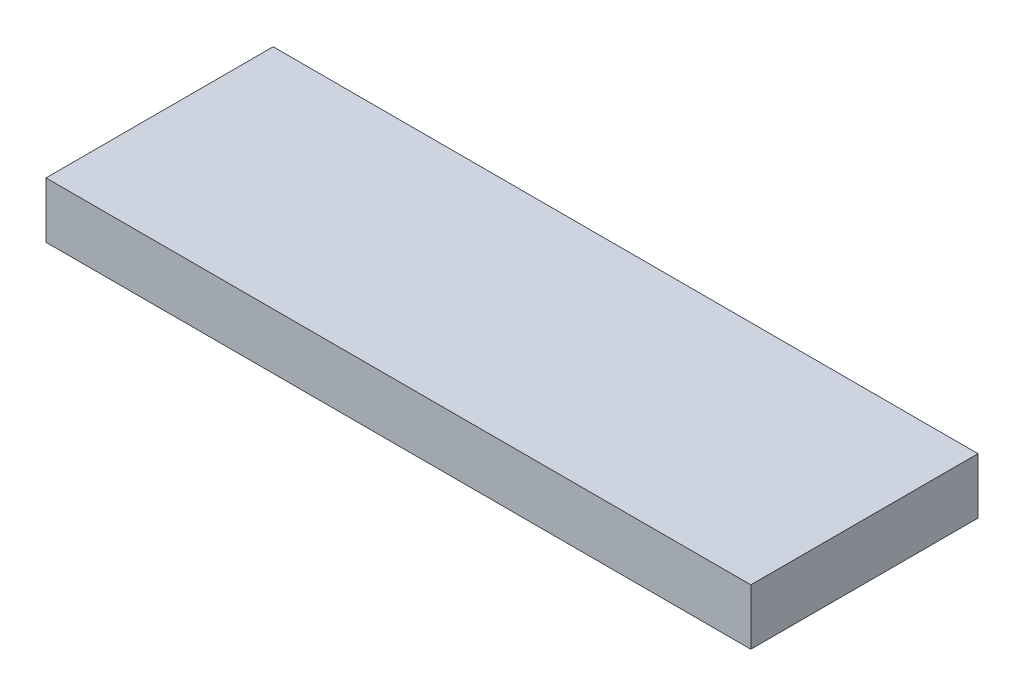
ISO-10303-21;
HEADER;
FILE_DESCRIPTION(('STEP AP214'),'2;1');
FILE_NAME('part.step','',(''),(''),'','','');
FILE_SCHEMA(('AUTOMOTIVE_DESIGN { 1 0 10303 214 1 1 1 1 }'));
ENDSEC;
DATA;
#1=APPLICATION_CONTEXT('core data for automotive mechanical design processes');
#2=APPLICATION_PROTOCOL_DEFINITION('international standard','automotive_design',2000,#1);
#3=PRODUCT_CONTEXT('',#1,'mechanical');
#4=PRODUCT('Part','Part','',(#3));
#5=PRODUCT_RELATED_PRODUCT_CATEGORY('part','',(#4));
#6=PRODUCT_DEFINITION_FORMATION('','',#4);
#7=PRODUCT_DEFINITION_CONTEXT('part definition',#1,'design');
#8=PRODUCT_DEFINITION('design','',#6,#7);
#9=PRODUCT_DEFINITION_SHAPE('','',#8);
#10=(LENGTH_UNIT() NAMED_UNIT(*) SI_UNIT(.MILLI.,.METRE.));
#11=(NAMED_UNIT(*) PLANE_ANGLE_UNIT() SI_UNIT($,.RADIAN.));
#12=(NAMED_UNIT(*) SI_UNIT($,.STERADIAN.) SOLID_ANGLE_UNIT());
#13=UNCERTAINTY_MEASURE_WITH_UNIT(LENGTH_MEASURE(1.E-05),#10,'distance_accuracy_value','');
#14=(GEOMETRIC_REPRESENTATION_CONTEXT(3) GLOBAL_UNCERTAINTY_ASSIGNED_CONTEXT((#13)) GLOBAL_UNIT_ASSIGNED_CONTEXT((#10,
#11,#12)) REPRESENTATION_CONTEXT('',''));
#15=CARTESIAN_POINT('',(0.,0.,0.));
#16=DIRECTION('',(0.,0.,1.));
#17=DIRECTION('',(1.,0.,0.));
#18=AXIS2_PLACEMENT_3D('',#15,#16,#17);
#19=CARTESIAN_POINT('',(10.09949212,-0.79949294,0.));
#20=DIRECTION('',(0.,-1.,0.));
#21=DIRECTION('',(0.,0.,-1.));
#22=AXIS2_PLACEMENT_3D('',#19,#20,#21);
#23=PLANE('',#22);
#24=DIRECTION('',(0.,0.,1.));
#25=VECTOR('',#24,1.);
#26=CARTESIAN_POINT('',(-10.09949212,-0.79949294,0.));
#27=LINE('',#26,#25);
#28=CARTESIAN_POINT('',(-10.09949212,-0.79949294,0.));
#29=VERTEX_POINT('',#28);
#30=CARTESIAN_POINT('',(-10.09949212,-0.79949294,6.51000222));
#31=VERTEX_POINT('',#30);
#32=EDGE_CURVE('E20',#29,#31,#27,.T.);
#33=ORIENTED_EDGE('',*,*,#32,.F.);
#34=DIRECTION('',(1.,0.,0.));
#35=VECTOR('',#34,1.);
#36=CARTESIAN_POINT('',(-10.09949212,-0.79949294,0.));
#37=LINE('',#36,#35);
#38=CARTESIAN_POINT('',(10.09949212,-0.79949294,0.));
#39=VERTEX_POINT('',#38);
#40=EDGE_CURVE('E79',#29,#39,#37,.T.);
#41=ORIENTED_EDGE('',*,*,#40,.T.);
#42=DIRECTION('',(0.,0.,-1.));
#43=VECTOR('',#42,1.);
#44=CARTESIAN_POINT('',(10.09949212,-0.79949294,0.));
#45=LINE('',#44,#43);
#46=CARTESIAN_POINT('',(10.09949212,-0.79949294,6.51000222));
#47=VERTEX_POINT('',#46);
#48=EDGE_CURVE('E61',#47,#39,#45,.T.);
#49=ORIENTED_EDGE('',*,*,#48,.F.);
#50=DIRECTION('',(1.,0.,0.));
#51=VECTOR('',#50,1.);
#52=CARTESIAN_POINT('',(-10.09949212,-0.79949294,6.51000222));
#53=LINE('',#52,#51);
#54=EDGE_CURVE('E56',#31,#47,#53,.T.);
#55=ORIENTED_EDGE('',*,*,#54,.F.);
#56=EDGE_LOOP('',(#33,#41,#49,#55));
#57=FACE_BOUND('',#56,.T.);
#58=ADVANCED_FACE('F17',(#57),#23,.T.);
#59=CARTESIAN_POINT('',(-10.09949212,-0.79949294,0.));
#60=DIRECTION('',(-1.,0.,0.));
#61=DIRECTION('',(0.,0.,1.));
#62=AXIS2_PLACEMENT_3D('',#59,#60,#61);
#63=PLANE('',#62);
#64=DIRECTION('',(0.,0.,1.));
#65=VECTOR('',#64,1.);
#66=CARTESIAN_POINT('',(-10.09949212,0.79949294,0.));
#67=LINE('',#66,#65);
#68=CARTESIAN_POINT('',(-10.09949212,0.79949294,0.));
#69=VERTEX_POINT('',#68);
#70=CARTESIAN_POINT('',(-10.09949212,0.79949294,6.51000222));
#71=VERTEX_POINT('',#70);
#72=EDGE_CURVE('E83',#69,#71,#67,.T.);
#73=ORIENTED_EDGE('',*,*,#72,.F.);
#74=DIRECTION('',(0.,1.,0.));
#75=VECTOR('',#74,1.);
#76=CARTESIAN_POINT('',(-10.09949212,-0.79949294,0.));
#77=LINE('',#76,#75);
#78=EDGE_CURVE('E68',#69,#29,#77,.F.);
#79=ORIENTED_EDGE('',*,*,#78,.T.);
#80=ORIENTED_EDGE('',*,*,#32,.T.);
#81=DIRECTION('',(0.,1.,0.));
#82=VECTOR('',#81,1.);
#83=CARTESIAN_POINT('',(-10.09949212,-0.79949294,6.51000222));
#84=LINE('',#83,#82);
#85=EDGE_CURVE('E63',#71,#31,#84,.F.);
#86=ORIENTED_EDGE('',*,*,#85,.F.);
#87=EDGE_LOOP('',(#73,#79,#80,#86));
#88=FACE_BOUND('',#87,.T.);
#89=ADVANCED_FACE('F65',(#88),#63,.T.);
#90=CARTESIAN_POINT('',(-10.09949212,-0.79949294,6.51000222));
#91=DIRECTION('',(0.,0.,1.));
#92=DIRECTION('',(1.,0.,0.));
#93=AXIS2_PLACEMENT_3D('',#90,#91,#92);
#94=PLANE('',#93);
#95=DIRECTION('',(1.,0.,0.));
#96=VECTOR('',#95,1.);
#97=CARTESIAN_POINT('',(-10.09949212,0.79949294,6.51000222));
#98=LINE('',#97,#96);
#99=CARTESIAN_POINT('',(10.09949212,0.79949294,6.51000222));
#100=VERTEX_POINT('',#99);
#101=EDGE_CURVE('E72',#71,#100,#98,.T.);
#102=ORIENTED_EDGE('',*,*,#101,.F.);
#103=ORIENTED_EDGE('',*,*,#85,.T.);
#104=ORIENTED_EDGE('',*,*,#54,.T.);
#105=DIRECTION('',(0.,1.,0.));
#106=VECTOR('',#105,1.);
#107=CARTESIAN_POINT('',(10.09949212,0.79949294,6.51000222));
#108=LINE('',#107,#106);
#109=EDGE_CURVE('E74',#100,#47,#108,.F.);
#110=ORIENTED_EDGE('',*,*,#109,.F.);
#111=EDGE_LOOP('',(#102,#103,#104,#110));
#112=FACE_BOUND('',#111,.T.);
#113=ADVANCED_FACE('F70',(#112),#94,.T.);
#114=CARTESIAN_POINT('',(10.09949212,0.79949294,0.));
#115=DIRECTION('',(1.,0.,0.));
#116=DIRECTION('',(0.,0.,-1.));
#117=AXIS2_PLACEMENT_3D('',#114,#115,#116);
#118=PLANE('',#117);
#119=ORIENTED_EDGE('',*,*,#48,.T.);
#120=DIRECTION('',(0.,1.,0.));
#121=VECTOR('',#120,1.);
#122=CARTESIAN_POINT('',(10.09949212,-0.79949294,0.));
#123=LINE('',#122,#121);
#124=CARTESIAN_POINT('',(10.09949212,0.79949294,0.));
#125=VERTEX_POINT('',#124);
#126=EDGE_CURVE('E35',#39,#125,#123,.T.);
#127=ORIENTED_EDGE('',*,*,#126,.T.);
#128=DIRECTION('',(0.,0.,1.));
#129=VECTOR('',#128,1.);
#130=CARTESIAN_POINT('',(10.09949212,0.79949294,0.));
#131=LINE('',#130,#129);
#132=EDGE_CURVE('E26',#100,#125,#131,.F.);
#133=ORIENTED_EDGE('',*,*,#132,.F.);
#134=ORIENTED_EDGE('',*,*,#109,.T.);
#135=EDGE_LOOP('',(#119,#127,#133,#134));
#136=FACE_BOUND('',#135,.T.);
#137=ADVANCED_FACE('F89',(#136),#118,.T.);
#138=CARTESIAN_POINT('',(-10.09949212,-0.79949294,0.));
#139=DIRECTION('',(0.,0.,1.));
#140=DIRECTION('',(1.,0.,0.));
#141=AXIS2_PLACEMENT_3D('',#138,#139,#140);
#142=PLANE('',#141);
#143=DIRECTION('',(1.,0.,0.));
#144=VECTOR('',#143,1.);
#145=CARTESIAN_POINT('',(-10.09949212,0.79949294,0.));
#146=LINE('',#145,#144);
#147=EDGE_CURVE('E11',#125,#69,#146,.F.);
#148=ORIENTED_EDGE('',*,*,#147,.F.);
#149=ORIENTED_EDGE('',*,*,#126,.F.);
#150=ORIENTED_EDGE('',*,*,#40,.F.);
#151=ORIENTED_EDGE('',*,*,#78,.F.);
#152=EDGE_LOOP('',(#148,#149,#150,#151));
#153=FACE_BOUND('',#152,.T.);
#154=ADVANCED_FACE('F91',(#153),#142,.F.);
#155=CARTESIAN_POINT('',(-10.09949212,0.79949294,0.));
#156=DIRECTION('',(0.,1.,0.));
#157=DIRECTION('',(0.,0.,1.));
#158=AXIS2_PLACEMENT_3D('',#155,#156,#157);
#159=PLANE('',#158);
#160=ORIENTED_EDGE('',*,*,#132,.T.);
#161=ORIENTED_EDGE('',*,*,#147,.T.);
#162=ORIENTED_EDGE('',*,*,#72,.T.);
#163=ORIENTED_EDGE('',*,*,#101,.T.);
#164=EDGE_LOOP('',(#160,#161,#162,#163));
#165=FACE_BOUND('',#164,.T.);
#166=ADVANCED_FACE('F88',(#165),#159,.T.);
#167=CLOSED_SHELL('',(#58,#89,#113,#137,#154,#166));
#168=MANIFOLD_SOLID_BREP('B1',#167);
#169=ADVANCED_BREP_SHAPE_REPRESENTATION('',(#18,#168),#14);
#170=SHAPE_DEFINITION_REPRESENTATION(#9,#169);
ENDSEC;
END-ISO-10303-21;
